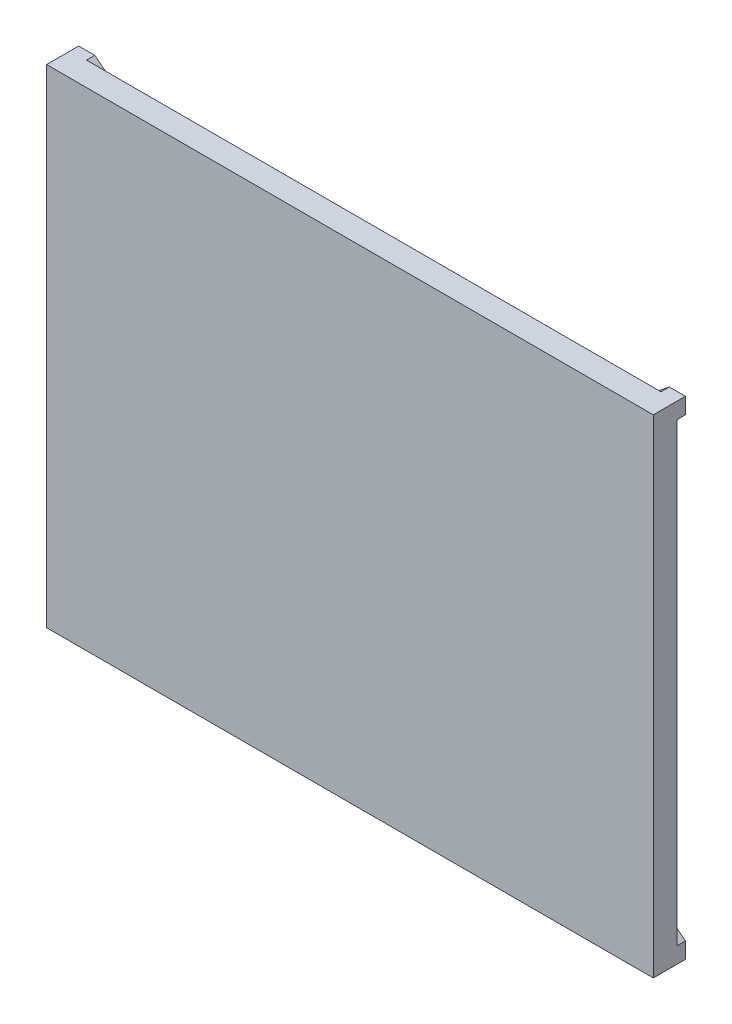
ISO-10303-21;
HEADER;
FILE_DESCRIPTION(('STEP AP214'),'2;1');
FILE_NAME('part.step','',(''),(''),'','','');
FILE_SCHEMA(('AUTOMOTIVE_DESIGN { 1 0 10303 214 1 1 1 1 }'));
ENDSEC;
DATA;
#1=APPLICATION_CONTEXT('core data for automotive mechanical design processes');
#2=APPLICATION_PROTOCOL_DEFINITION('international standard','automotive_design',2000,#1);
#3=PRODUCT_CONTEXT('',#1,'mechanical');
#4=PRODUCT('Part','Part','',(#3));
#5=PRODUCT_RELATED_PRODUCT_CATEGORY('part','',(#4));
#6=PRODUCT_DEFINITION_FORMATION('','',#4);
#7=PRODUCT_DEFINITION_CONTEXT('part definition',#1,'design');
#8=PRODUCT_DEFINITION('design','',#6,#7);
#9=PRODUCT_DEFINITION_SHAPE('','',#8);
#10=(LENGTH_UNIT() NAMED_UNIT(*) SI_UNIT(.MILLI.,.METRE.));
#11=(NAMED_UNIT(*) PLANE_ANGLE_UNIT() SI_UNIT($,.RADIAN.));
#12=(NAMED_UNIT(*) SI_UNIT($,.STERADIAN.) SOLID_ANGLE_UNIT());
#13=UNCERTAINTY_MEASURE_WITH_UNIT(LENGTH_MEASURE(1.E-05),#10,'distance_accuracy_value','');
#14=(GEOMETRIC_REPRESENTATION_CONTEXT(3) GLOBAL_UNCERTAINTY_ASSIGNED_CONTEXT((#13)) GLOBAL_UNIT_ASSIGNED_CONTEXT((#10,
#11,#12)) REPRESENTATION_CONTEXT('',''));
#15=CARTESIAN_POINT('',(0.,0.,0.));
#16=DIRECTION('',(0.,0.,1.));
#17=DIRECTION('',(1.,0.,0.));
#18=AXIS2_PLACEMENT_3D('',#15,#16,#17);
#19=CARTESIAN_POINT('',(0.,0.,0.));
#20=DIRECTION('',(0.,0.,-1.));
#21=DIRECTION('',(-1.,0.,0.));
#22=AXIS2_PLACEMENT_3D('',#19,#20,#21);
#23=PLANE('',#22);
#24=DIRECTION('',(0.781408863994318,-0.624019380525244,0.));
#25=VECTOR('',#24,1.);
#26=CARTESIAN_POINT('',(482.961977853953,-410.,0.));
#27=LINE('',#26,#25);
#28=CARTESIAN_POINT('',(-510.,382.961977853953,0.));
#29=VERTEX_POINT('',#28);
#30=CARTESIAN_POINT('',(-30.4477722855458,0.,0.));
#31=VERTEX_POINT('',#30);
#32=EDGE_CURVE('E187',#29,#31,#27,.T.);
#33=ORIENTED_EDGE('',*,*,#32,.T.);
#34=DIRECTION('',(0.781408863994318,0.624019380525244,0.));
#35=VECTOR('',#34,1.);
#36=CARTESIAN_POINT('',(482.961977853953,410.,0.));
#37=LINE('',#36,#35);
#38=CARTESIAN_POINT('',(-510.,-382.961977853953,0.));
#39=VERTEX_POINT('',#38);
#40=EDGE_CURVE('E209',#39,#31,#37,.T.);
#41=ORIENTED_EDGE('',*,*,#40,.F.);
#42=DIRECTION('',(0.,-1.,0.));
#43=VECTOR('',#42,1.);
#44=CARTESIAN_POINT('',(-510.,-410.,0.));
#45=LINE('',#44,#43);
#46=EDGE_CURVE('E36',#29,#39,#45,.T.);
#47=ORIENTED_EDGE('',*,*,#46,.F.);
#48=EDGE_LOOP('',(#33,#41,#47));
#49=FACE_BOUND('',#48,.T.);
#50=ADVANCED_FACE('F32',(#49),#23,.T.);
#51=CARTESIAN_POINT('',(3.33066907387547E-13,-24.3150556328195,0.));
#52=VERTEX_POINT('',#51);
#53=CARTESIAN_POINT('',(482.961977853953,-410.,0.));
#54=VERTEX_POINT('',#53);
#55=EDGE_CURVE('E189',#52,#54,#27,.T.);
#56=ORIENTED_EDGE('',*,*,#55,.T.);
#57=DIRECTION('',(1.,0.,0.));
#58=VECTOR('',#57,1.);
#59=CARTESIAN_POINT('',(-510.,-410.,0.));
#60=LINE('',#59,#58);
#61=CARTESIAN_POINT('',(-482.961977853953,-410.,0.));
#62=VERTEX_POINT('',#61);
#63=EDGE_CURVE('E162',#62,#54,#60,.T.);
#64=ORIENTED_EDGE('',*,*,#63,.F.);
#65=DIRECTION('',(-0.781408863994318,-0.624019380525244,0.));
#66=VECTOR('',#65,1.);
#67=CARTESIAN_POINT('',(-482.961977853953,-410.,0.));
#68=LINE('',#67,#66);
#69=EDGE_CURVE('E204',#52,#62,#68,.T.);
#70=ORIENTED_EDGE('',*,*,#69,.F.);
#71=EDGE_LOOP('',(#56,#64,#70));
#72=FACE_BOUND('',#71,.T.);
#73=ADVANCED_FACE('F326',(#72),#23,.T.);
#74=CARTESIAN_POINT('',(-482.961977853953,-410.,-14.));
#75=DIRECTION('',(-0.624019380525244,0.781408863994318,0.));
#76=DIRECTION('',(-0.781408863994318,-0.624019380525244,0.));
#77=AXIS2_PLACEMENT_3D('',#74,#75,#76);
#78=PLANE('',#77);
#79=DIRECTION('',(-0.781408863994318,-0.624019380525244,0.));
#80=VECTOR('',#79,1.);
#81=CARTESIAN_POINT('',(-482.961977853953,-410.,-14.));
#82=LINE('',#81,#80);
#83=CARTESIAN_POINT('',(0.,-24.3150556328195,-14.));
#84=VERTEX_POINT('',#83);
#85=CARTESIAN_POINT('',(-482.961977853953,-410.,-14.));
#86=VERTEX_POINT('',#85);
#87=EDGE_CURVE('E211',#84,#86,#82,.T.);
#88=ORIENTED_EDGE('',*,*,#87,.F.);
#89=DIRECTION('',(0.,0.,1.));
#90=VECTOR('',#89,1.);
#91=CARTESIAN_POINT('',(1.11022302462516E-13,-24.3150556328194,-14.));
#92=LINE('',#91,#90);
#93=EDGE_CURVE('E149',#84,#52,#92,.T.);
#94=ORIENTED_EDGE('',*,*,#93,.T.);
#95=ORIENTED_EDGE('',*,*,#69,.T.);
#96=DIRECTION('',(0.,0.,1.));
#97=VECTOR('',#96,1.);
#98=CARTESIAN_POINT('',(-482.961977853953,-410.,-14.));
#99=LINE('',#98,#97);
#100=EDGE_CURVE('E311',#86,#62,#99,.T.);
#101=ORIENTED_EDGE('',*,*,#100,.F.);
#102=EDGE_LOOP('',(#88,#94,#95,#101));
#103=FACE_BOUND('',#102,.T.);
#104=ADVANCED_FACE('F323',(#103),#78,.F.);
#105=CARTESIAN_POINT('',(482.961977853953,410.,-14.));
#106=DIRECTION('',(0.624019380525244,-0.781408863994318,0.));
#107=DIRECTION('',(0.781408863994318,0.624019380525244,0.));
#108=AXIS2_PLACEMENT_3D('',#105,#106,#107);
#109=PLANE('',#108);
#110=ORIENTED_EDGE('',*,*,#40,.T.);
#111=DIRECTION('',(0.,0.,-1.));
#112=VECTOR('',#111,1.);
#113=CARTESIAN_POINT('',(-30.4477722855459,0.,-14.));
#114=LINE('',#113,#112);
#115=CARTESIAN_POINT('',(-30.4477722855458,0.,-14.));
#116=VERTEX_POINT('',#115);
#117=EDGE_CURVE('E200',#31,#116,#114,.T.);
#118=ORIENTED_EDGE('',*,*,#117,.T.);
#119=DIRECTION('',(0.781408863994318,0.624019380525244,0.));
#120=VECTOR('',#119,1.);
#121=CARTESIAN_POINT('',(482.961977853953,410.,-14.));
#122=LINE('',#121,#120);
#123=CARTESIAN_POINT('',(-510.,-382.961977853953,-14.));
#124=VERTEX_POINT('',#123);
#125=EDGE_CURVE('E220',#124,#116,#122,.T.);
#126=ORIENTED_EDGE('',*,*,#125,.F.);
#127=DIRECTION('',(0.,0.,1.));
#128=VECTOR('',#127,1.);
#129=CARTESIAN_POINT('',(-510.,-382.961977853953,-14.));
#130=LINE('',#129,#128);
#131=EDGE_CURVE('E308',#124,#39,#130,.T.);
#132=ORIENTED_EDGE('',*,*,#131,.T.);
#133=EDGE_LOOP('',(#110,#118,#126,#132));
#134=FACE_BOUND('',#133,.T.);
#135=ADVANCED_FACE('F333',(#134),#109,.F.);
#136=DIRECTION('',(-0.781408863994318,0.624019380525244,0.));
#137=VECTOR('',#136,1.);
#138=CARTESIAN_POINT('',(-482.961977853953,410.,0.));
#139=LINE('',#138,#137);
#140=CARTESIAN_POINT('',(0.,24.3150556328195,0.));
#141=VERTEX_POINT('',#140);
#142=CARTESIAN_POINT('',(-482.961977853953,410.,0.));
#143=VERTEX_POINT('',#142);
#144=EDGE_CURVE('E174',#141,#143,#139,.T.);
#145=ORIENTED_EDGE('',*,*,#144,.T.);
#146=DIRECTION('',(-1.,0.,0.));
#147=VECTOR('',#146,1.);
#148=CARTESIAN_POINT('',(-510.,410.,0.));
#149=LINE('',#148,#147);
#150=CARTESIAN_POINT('',(482.961977853953,410.,0.));
#151=VERTEX_POINT('',#150);
#152=EDGE_CURVE('E239',#151,#143,#149,.T.);
#153=ORIENTED_EDGE('',*,*,#152,.F.);
#154=EDGE_CURVE('E235',#141,#151,#37,.T.);
#155=ORIENTED_EDGE('',*,*,#154,.F.);
#156=EDGE_LOOP('',(#145,#153,#155));
#157=FACE_BOUND('',#156,.T.);
#158=ADVANCED_FACE('F276',(#157),#23,.T.);
#159=CARTESIAN_POINT('',(510.,-410.,40.));
#160=DIRECTION('',(-1.,0.,0.));
#161=DIRECTION('',(0.,0.,1.));
#162=AXIS2_PLACEMENT_3D('',#159,#160,#161);
#163=PLANE('',#162);
#164=DIRECTION('',(0.,0.,-1.));
#165=VECTOR('',#164,1.);
#166=CARTESIAN_POINT('',(510.,-410.,40.));
#167=LINE('',#166,#165);
#168=CARTESIAN_POINT('',(510.,-410.,40.));
#169=VERTEX_POINT('',#168);
#170=CARTESIAN_POINT('',(510.,-410.,-14.));
#171=VERTEX_POINT('',#170);
#172=EDGE_CURVE('E255',#169,#171,#167,.T.);
#173=ORIENTED_EDGE('',*,*,#172,.T.);
#174=DIRECTION('',(0.,1.,0.));
#175=VECTOR('',#174,1.);
#176=CARTESIAN_POINT('',(510.,-382.961977853953,-14.));
#177=LINE('',#176,#175);
#178=CARTESIAN_POINT('',(510.,-382.961977853953,-14.));
#179=VERTEX_POINT('',#178);
#180=EDGE_CURVE('E170',#171,#179,#177,.T.);
#181=ORIENTED_EDGE('',*,*,#180,.T.);
#182=DIRECTION('',(0.,0.,1.));
#183=VECTOR('',#182,1.);
#184=CARTESIAN_POINT('',(510.,-382.961977853953,-14.));
#185=LINE('',#184,#183);
#186=CARTESIAN_POINT('',(510.,-382.961977853953,0.));
#187=VERTEX_POINT('',#186);
#188=EDGE_CURVE('E186',#179,#187,#185,.T.);
#189=ORIENTED_EDGE('',*,*,#188,.T.);
#190=DIRECTION('',(0.,1.,0.));
#191=VECTOR('',#190,1.);
#192=CARTESIAN_POINT('',(510.,-410.,0.));
#193=LINE('',#192,#191);
#194=CARTESIAN_POINT('',(510.,382.961977853953,0.));
#195=VERTEX_POINT('',#194);
#196=EDGE_CURVE('E237',#187,#195,#193,.T.);
#197=ORIENTED_EDGE('',*,*,#196,.T.);
#198=DIRECTION('',(0.,0.,1.));
#199=VECTOR('',#198,1.);
#200=CARTESIAN_POINT('',(510.,382.961977853953,-14.));
#201=LINE('',#200,#199);
#202=CARTESIAN_POINT('',(510.,382.961977853953,-14.));
#203=VERTEX_POINT('',#202);
#204=EDGE_CURVE('E240',#203,#195,#201,.T.);
#205=ORIENTED_EDGE('',*,*,#204,.F.);
#206=DIRECTION('',(0.,-1.,0.));
#207=VECTOR('',#206,1.);
#208=CARTESIAN_POINT('',(510.,382.961977853953,-14.));
#209=LINE('',#208,#207);
#210=CARTESIAN_POINT('',(510.,410.,-14.));
#211=VERTEX_POINT('',#210);
#212=EDGE_CURVE('E208',#211,#203,#209,.T.);
#213=ORIENTED_EDGE('',*,*,#212,.F.);
#214=DIRECTION('',(0.,0.,-1.));
#215=VECTOR('',#214,1.);
#216=CARTESIAN_POINT('',(510.,410.,40.));
#217=LINE('',#216,#215);
#218=CARTESIAN_POINT('',(510.,410.,40.));
#219=VERTEX_POINT('',#218);
#220=EDGE_CURVE('E11',#219,#211,#217,.T.);
#221=ORIENTED_EDGE('',*,*,#220,.F.);
#222=DIRECTION('',(0.,1.,0.));
#223=VECTOR('',#222,1.);
#224=CARTESIAN_POINT('',(510.,-410.,40.));
#225=LINE('',#224,#223);
#226=EDGE_CURVE('E251',#169,#219,#225,.T.);
#227=ORIENTED_EDGE('',*,*,#226,.F.);
#228=EDGE_LOOP('',(#173,#181,#189,#197,#205,#213,#221,#227));
#229=FACE_BOUND('',#228,.T.);
#230=ADVANCED_FACE('F34',(#229),#163,.F.);
#231=CARTESIAN_POINT('',(-510.,410.,40.));
#232=DIRECTION('',(0.,-1.,0.));
#233=DIRECTION('',(0.,0.,-1.));
#234=AXIS2_PLACEMENT_3D('',#231,#232,#233);
#235=PLANE('',#234);
#236=ORIENTED_EDGE('',*,*,#220,.T.);
#237=DIRECTION('',(1.,0.,0.));
#238=VECTOR('',#237,1.);
#239=CARTESIAN_POINT('',(510.,410.,-14.));
#240=LINE('',#239,#238);
#241=CARTESIAN_POINT('',(482.961977853953,410.,-14.));
#242=VERTEX_POINT('',#241);
#243=EDGE_CURVE('E205',#242,#211,#240,.T.);
#244=ORIENTED_EDGE('',*,*,#243,.F.);
#245=DIRECTION('',(0.,0.,1.));
#246=VECTOR('',#245,1.);
#247=CARTESIAN_POINT('',(482.961977853953,410.,-14.));
#248=LINE('',#247,#246);
#249=EDGE_CURVE('E223',#242,#151,#248,.T.);
#250=ORIENTED_EDGE('',*,*,#249,.T.);
#251=ORIENTED_EDGE('',*,*,#152,.T.);
#252=DIRECTION('',(0.,0.,1.));
#253=VECTOR('',#252,1.);
#254=CARTESIAN_POINT('',(-482.961977853953,410.,-14.));
#255=LINE('',#254,#253);
#256=CARTESIAN_POINT('',(-482.961977853953,410.,-14.));
#257=VERTEX_POINT('',#256);
#258=EDGE_CURVE('E192',#257,#143,#255,.T.);
#259=ORIENTED_EDGE('',*,*,#258,.F.);
#260=DIRECTION('',(-1.,0.,0.));
#261=VECTOR('',#260,1.);
#262=CARTESIAN_POINT('',(-510.,410.,-14.));
#263=LINE('',#262,#261);
#264=CARTESIAN_POINT('',(-510.,410.,-14.));
#265=VERTEX_POINT('',#264);
#266=EDGE_CURVE('E180',#257,#265,#263,.T.);
#267=ORIENTED_EDGE('',*,*,#266,.T.);
#268=DIRECTION('',(0.,0.,-1.));
#269=VECTOR('',#268,1.);
#270=CARTESIAN_POINT('',(-510.,410.,40.));
#271=LINE('',#270,#269);
#272=CARTESIAN_POINT('',(-510.,410.,40.));
#273=VERTEX_POINT('',#272);
#274=EDGE_CURVE('E42',#273,#265,#271,.T.);
#275=ORIENTED_EDGE('',*,*,#274,.F.);
#276=DIRECTION('',(-1.,0.,0.));
#277=VECTOR('',#276,1.);
#278=CARTESIAN_POINT('',(-510.,410.,40.));
#279=LINE('',#278,#277);
#280=EDGE_CURVE('E301',#219,#273,#279,.T.);
#281=ORIENTED_EDGE('',*,*,#280,.F.);
#282=EDGE_LOOP('',(#236,#244,#250,#251,#259,#267,#275,#281));
#283=FACE_BOUND('',#282,.T.);
#284=ADVANCED_FACE('F268',(#283),#235,.F.);
#285=CARTESIAN_POINT('',(-510.,-410.,40.));
#286=DIRECTION('',(1.,0.,0.));
#287=DIRECTION('',(0.,0.,-1.));
#288=AXIS2_PLACEMENT_3D('',#285,#286,#287);
#289=PLANE('',#288);
#290=ORIENTED_EDGE('',*,*,#274,.T.);
#291=DIRECTION('',(0.,-1.,0.));
#292=VECTOR('',#291,1.);
#293=CARTESIAN_POINT('',(-510.,382.961977853953,-14.));
#294=LINE('',#293,#292);
#295=CARTESIAN_POINT('',(-510.,382.961977853953,-14.));
#296=VERTEX_POINT('',#295);
#297=EDGE_CURVE('E177',#265,#296,#294,.T.);
#298=ORIENTED_EDGE('',*,*,#297,.T.);
#299=DIRECTION('',(0.,0.,1.));
#300=VECTOR('',#299,1.);
#301=CARTESIAN_POINT('',(-510.,382.961977853953,-14.));
#302=LINE('',#301,#300);
#303=EDGE_CURVE('E164',#296,#29,#302,.T.);
#304=ORIENTED_EDGE('',*,*,#303,.T.);
#305=ORIENTED_EDGE('',*,*,#46,.T.);
#306=ORIENTED_EDGE('',*,*,#131,.F.);
#307=DIRECTION('',(0.,1.,0.));
#308=VECTOR('',#307,1.);
#309=CARTESIAN_POINT('',(-510.,-382.961977853953,-14.));
#310=LINE('',#309,#308);
#311=CARTESIAN_POINT('',(-510.,-410.,-14.));
#312=VERTEX_POINT('',#311);
#313=EDGE_CURVE('E217',#312,#124,#310,.T.);
#314=ORIENTED_EDGE('',*,*,#313,.F.);
#315=DIRECTION('',(0.,0.,-1.));
#316=VECTOR('',#315,1.);
#317=CARTESIAN_POINT('',(-510.,-410.,40.));
#318=LINE('',#317,#316);
#319=CARTESIAN_POINT('',(-510.,-410.,40.));
#320=VERTEX_POINT('',#319);
#321=EDGE_CURVE('E257',#320,#312,#318,.T.);
#322=ORIENTED_EDGE('',*,*,#321,.F.);
#323=DIRECTION('',(0.,-1.,0.));
#324=VECTOR('',#323,1.);
#325=CARTESIAN_POINT('',(-510.,-410.,40.));
#326=LINE('',#325,#324);
#327=EDGE_CURVE('E264',#273,#320,#326,.T.);
#328=ORIENTED_EDGE('',*,*,#327,.F.);
#329=EDGE_LOOP('',(#290,#298,#304,#305,#306,#314,#322,#328));
#330=FACE_BOUND('',#329,.T.);
#331=ADVANCED_FACE('F262',(#330),#289,.F.);
#332=CARTESIAN_POINT('',(-510.,-410.,40.));
#333=DIRECTION('',(0.,1.,0.));
#334=DIRECTION('',(0.,0.,1.));
#335=AXIS2_PLACEMENT_3D('',#332,#333,#334);
#336=PLANE('',#335);
#337=ORIENTED_EDGE('',*,*,#321,.T.);
#338=DIRECTION('',(-1.,0.,0.));
#339=VECTOR('',#338,1.);
#340=CARTESIAN_POINT('',(-510.,-410.,-14.));
#341=LINE('',#340,#339);
#342=EDGE_CURVE('E214',#86,#312,#341,.T.);
#343=ORIENTED_EDGE('',*,*,#342,.F.);
#344=ORIENTED_EDGE('',*,*,#100,.T.);
#345=ORIENTED_EDGE('',*,*,#63,.T.);
#346=DIRECTION('',(0.,0.,1.));
#347=VECTOR('',#346,1.);
#348=CARTESIAN_POINT('',(482.961977853953,-410.,-14.));
#349=LINE('',#348,#347);
#350=CARTESIAN_POINT('',(482.961977853953,-410.,-14.));
#351=VERTEX_POINT('',#350);
#352=EDGE_CURVE('E146',#351,#54,#349,.T.);
#353=ORIENTED_EDGE('',*,*,#352,.F.);
#354=DIRECTION('',(1.,0.,0.));
#355=VECTOR('',#354,1.);
#356=CARTESIAN_POINT('',(510.,-410.,-14.));
#357=LINE('',#356,#355);
#358=EDGE_CURVE('E152',#351,#171,#357,.T.);
#359=ORIENTED_EDGE('',*,*,#358,.T.);
#360=ORIENTED_EDGE('',*,*,#172,.F.);
#361=DIRECTION('',(1.,0.,0.));
#362=VECTOR('',#361,1.);
#363=CARTESIAN_POINT('',(-510.,-410.,40.));
#364=LINE('',#363,#362);
#365=EDGE_CURVE('E244',#320,#169,#364,.T.);
#366=ORIENTED_EDGE('',*,*,#365,.F.);
#367=EDGE_LOOP('',(#337,#343,#344,#345,#353,#359,#360,#366));
#368=FACE_BOUND('',#367,.T.);
#369=ADVANCED_FACE('F157',(#368),#336,.F.);
#370=CARTESIAN_POINT('',(0.,0.,40.));
#371=DIRECTION('',(0.,0.,-1.));
#372=DIRECTION('',(-1.,0.,0.));
#373=AXIS2_PLACEMENT_3D('',#370,#371,#372);
#374=PLANE('',#373);
#375=ORIENTED_EDGE('',*,*,#226,.T.);
#376=ORIENTED_EDGE('',*,*,#280,.T.);
#377=ORIENTED_EDGE('',*,*,#327,.T.);
#378=ORIENTED_EDGE('',*,*,#365,.T.);
#379=EDGE_LOOP('',(#375,#376,#377,#378));
#380=FACE_BOUND('',#379,.T.);
#381=ADVANCED_FACE('F303',(#380),#374,.F.);
#382=CARTESIAN_POINT('',(30.4477722855461,0.,0.));
#383=VERTEX_POINT('',#382);
#384=EDGE_CURVE('E171',#187,#383,#139,.T.);
#385=ORIENTED_EDGE('',*,*,#384,.T.);
#386=EDGE_CURVE('E230',#195,#383,#68,.T.);
#387=ORIENTED_EDGE('',*,*,#386,.F.);
#388=ORIENTED_EDGE('',*,*,#196,.F.);
#389=EDGE_LOOP('',(#385,#387,#388));
#390=FACE_BOUND('',#389,.T.);
#391=ADVANCED_FACE('F290',(#390),#23,.T.);
#392=ORIENTED_EDGE('',*,*,#386,.T.);
#393=DIRECTION('',(0.,0.,-1.));
#394=VECTOR('',#393,1.);
#395=CARTESIAN_POINT('',(30.447772285546,0.,-14.));
#396=LINE('',#395,#394);
#397=CARTESIAN_POINT('',(30.4477722855458,0.,-14.));
#398=VERTEX_POINT('',#397);
#399=EDGE_CURVE('E197',#383,#398,#396,.T.);
#400=ORIENTED_EDGE('',*,*,#399,.T.);
#401=EDGE_CURVE('E212',#203,#398,#82,.T.);
#402=ORIENTED_EDGE('',*,*,#401,.F.);
#403=ORIENTED_EDGE('',*,*,#204,.T.);
#404=EDGE_LOOP('',(#392,#400,#402,#403));
#405=FACE_BOUND('',#404,.T.);
#406=ADVANCED_FACE('F285',(#405),#78,.F.);
#407=CARTESIAN_POINT('',(1.77809156287623E-13,24.3150556328195,-14.));
#408=VERTEX_POINT('',#407);
#409=EDGE_CURVE('E219',#408,#242,#122,.T.);
#410=ORIENTED_EDGE('',*,*,#409,.F.);
#411=DIRECTION('',(0.,0.,1.));
#412=VECTOR('',#411,1.);
#413=CARTESIAN_POINT('',(0.,24.3150556328194,-14.));
#414=LINE('',#413,#412);
#415=EDGE_CURVE('E163',#408,#141,#414,.T.);
#416=ORIENTED_EDGE('',*,*,#415,.T.);
#417=ORIENTED_EDGE('',*,*,#154,.T.);
#418=ORIENTED_EDGE('',*,*,#249,.F.);
#419=EDGE_LOOP('',(#410,#416,#417,#418));
#420=FACE_BOUND('',#419,.T.);
#421=ADVANCED_FACE('F307',(#420),#109,.F.);
#422=CARTESIAN_POINT('',(0.,0.,-14.));
#423=DIRECTION('',(0.,0.,1.));
#424=DIRECTION('',(1.,0.,0.));
#425=AXIS2_PLACEMENT_3D('',#422,#423,#424);
#426=PLANE('',#425);
#427=ORIENTED_EDGE('',*,*,#401,.T.);
#428=DIRECTION('',(-0.781408863994318,0.624019380525244,0.));
#429=VECTOR('',#428,1.);
#430=CARTESIAN_POINT('',(-482.961977853953,410.,-14.));
#431=LINE('',#430,#429);
#432=EDGE_CURVE('E183',#179,#398,#431,.T.);
#433=ORIENTED_EDGE('',*,*,#432,.F.);
#434=ORIENTED_EDGE('',*,*,#180,.F.);
#435=ORIENTED_EDGE('',*,*,#358,.F.);
#436=DIRECTION('',(0.781408863994318,-0.624019380525244,0.));
#437=VECTOR('',#436,1.);
#438=CARTESIAN_POINT('',(482.961977853953,-410.,-14.));
#439=LINE('',#438,#437);
#440=EDGE_CURVE('E57',#84,#351,#439,.T.);
#441=ORIENTED_EDGE('',*,*,#440,.F.);
#442=ORIENTED_EDGE('',*,*,#87,.T.);
#443=ORIENTED_EDGE('',*,*,#342,.T.);
#444=ORIENTED_EDGE('',*,*,#313,.T.);
#445=ORIENTED_EDGE('',*,*,#125,.T.);
#446=EDGE_CURVE('E151',#296,#116,#439,.T.);
#447=ORIENTED_EDGE('',*,*,#446,.F.);
#448=ORIENTED_EDGE('',*,*,#297,.F.);
#449=ORIENTED_EDGE('',*,*,#266,.F.);
#450=EDGE_CURVE('E50',#408,#257,#431,.T.);
#451=ORIENTED_EDGE('',*,*,#450,.F.);
#452=ORIENTED_EDGE('',*,*,#409,.T.);
#453=ORIENTED_EDGE('',*,*,#243,.T.);
#454=ORIENTED_EDGE('',*,*,#212,.T.);
#455=EDGE_LOOP('',(#427,#433,#434,#435,#441,#442,#443,#444,#445,#447,#448,#449,#451,#452,#453,#454));
#456=FACE_BOUND('',#455,.T.);
#457=ADVANCED_FACE('F167',(#456),#426,.F.);
#458=CARTESIAN_POINT('',(-482.961977853953,410.,-14.));
#459=DIRECTION('',(0.624019380525244,0.781408863994318,0.));
#460=DIRECTION('',(-0.781408863994318,0.624019380525244,0.));
#461=AXIS2_PLACEMENT_3D('',#458,#459,#460);
#462=PLANE('',#461);
#463=ORIENTED_EDGE('',*,*,#415,.F.);
#464=ORIENTED_EDGE('',*,*,#450,.T.);
#465=ORIENTED_EDGE('',*,*,#258,.T.);
#466=ORIENTED_EDGE('',*,*,#144,.F.);
#467=EDGE_LOOP('',(#463,#464,#465,#466));
#468=FACE_BOUND('',#467,.T.);
#469=ADVANCED_FACE('F273',(#468),#462,.T.);
#470=CARTESIAN_POINT('',(482.961977853953,-410.,-14.));
#471=DIRECTION('',(-0.624019380525244,-0.781408863994318,0.));
#472=DIRECTION('',(0.781408863994318,-0.624019380525244,0.));
#473=AXIS2_PLACEMENT_3D('',#470,#471,#472);
#474=PLANE('',#473);
#475=ORIENTED_EDGE('',*,*,#117,.F.);
#476=ORIENTED_EDGE('',*,*,#32,.F.);
#477=ORIENTED_EDGE('',*,*,#303,.F.);
#478=ORIENTED_EDGE('',*,*,#446,.T.);
#479=EDGE_LOOP('',(#475,#476,#477,#478));
#480=FACE_BOUND('',#479,.T.);
#481=ADVANCED_FACE('F359',(#480),#474,.T.);
#482=ORIENTED_EDGE('',*,*,#93,.F.);
#483=ORIENTED_EDGE('',*,*,#440,.T.);
#484=ORIENTED_EDGE('',*,*,#352,.T.);
#485=ORIENTED_EDGE('',*,*,#55,.F.);
#486=EDGE_LOOP('',(#482,#483,#484,#485));
#487=FACE_BOUND('',#486,.T.);
#488=ADVANCED_FACE('F145',(#487),#474,.T.);
#489=ORIENTED_EDGE('',*,*,#399,.F.);
#490=ORIENTED_EDGE('',*,*,#384,.F.);
#491=ORIENTED_EDGE('',*,*,#188,.F.);
#492=ORIENTED_EDGE('',*,*,#432,.T.);
#493=EDGE_LOOP('',(#489,#490,#491,#492));
#494=FACE_BOUND('',#493,.T.);
#495=ADVANCED_FACE('F293',(#494),#462,.T.);
#496=CLOSED_SHELL('',(#50,#73,#104,#135,#158,#230,#284,#331,#369,#381,#391,#406,#421,#457,#469,
#481,#488,#495));
#497=MANIFOLD_SOLID_BREP('B2',#496);
#498=ADVANCED_BREP_SHAPE_REPRESENTATION('',(#18,#497),#14);
#499=SHAPE_DEFINITION_REPRESENTATION(#9,#498);
ENDSEC;
END-ISO-10303-21;
